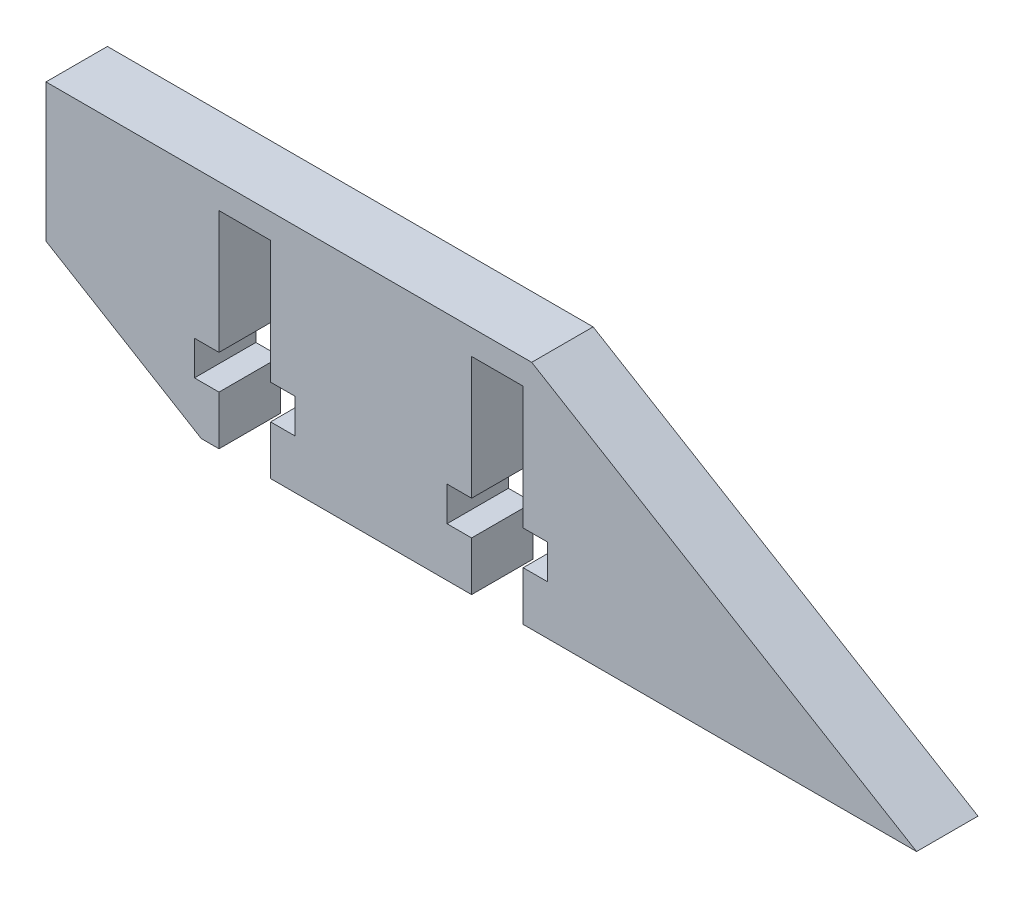
ISO-10303-21;
HEADER;
FILE_DESCRIPTION(('STEP AP214'),'2;1');
FILE_NAME('part.step','',(''),(''),'','','');
FILE_SCHEMA(('AUTOMOTIVE_DESIGN { 1 0 10303 214 1 1 1 1 }'));
ENDSEC;
DATA;
#1=APPLICATION_CONTEXT('core data for automotive mechanical design processes');
#2=APPLICATION_PROTOCOL_DEFINITION('international standard','automotive_design',2000,#1);
#3=PRODUCT_CONTEXT('',#1,'mechanical');
#4=PRODUCT('Part','Part','',(#3));
#5=PRODUCT_RELATED_PRODUCT_CATEGORY('part','',(#4));
#6=PRODUCT_DEFINITION_FORMATION('','',#4);
#7=PRODUCT_DEFINITION_CONTEXT('part definition',#1,'design');
#8=PRODUCT_DEFINITION('design','',#6,#7);
#9=PRODUCT_DEFINITION_SHAPE('','',#8);
#10=(LENGTH_UNIT() NAMED_UNIT(*) SI_UNIT(.MILLI.,.METRE.));
#11=(NAMED_UNIT(*) PLANE_ANGLE_UNIT() SI_UNIT($,.RADIAN.));
#12=(NAMED_UNIT(*) SI_UNIT($,.STERADIAN.) SOLID_ANGLE_UNIT());
#13=UNCERTAINTY_MEASURE_WITH_UNIT(LENGTH_MEASURE(1.E-05),#10,'distance_accuracy_value','');
#14=(GEOMETRIC_REPRESENTATION_CONTEXT(3) GLOBAL_UNCERTAINTY_ASSIGNED_CONTEXT((#13)) GLOBAL_UNIT_ASSIGNED_CONTEXT((#10,
#11,#12)) REPRESENTATION_CONTEXT('',''));
#15=CARTESIAN_POINT('',(0.,0.,0.));
#16=DIRECTION('',(0.,0.,1.));
#17=DIRECTION('',(1.,0.,0.));
#18=AXIS2_PLACEMENT_3D('',#15,#16,#17);
#19=CARTESIAN_POINT('',(-282.039404117024,408.696835159229,-223.000000000622));
#20=DIRECTION('',(0.,-1.,0.));
#21=DIRECTION('',(1.,0.,0.));
#22=AXIS2_PLACEMENT_3D('',#19,#20,#21);
#23=PLANE('',#22);
#24=DIRECTION('',(0.,0.,-1.));
#25=VECTOR('',#24,1.);
#26=CARTESIAN_POINT('',(-318.275750373979,408.696835159229,-218.000000000622));
#27=LINE('',#26,#25);
#28=CARTESIAN_POINT('',(-318.275750373979,408.696835159229,-218.000000000622));
#29=VERTEX_POINT('',#28);
#30=CARTESIAN_POINT('',(-318.275750373979,408.696835159229,-223.000000000622));
#31=VERTEX_POINT('',#30);
#32=EDGE_CURVE('E279',#29,#31,#27,.T.);
#33=ORIENTED_EDGE('',*,*,#32,.F.);
#34=DIRECTION('',(1.,0.,0.));
#35=VECTOR('',#34,1.);
#36=CARTESIAN_POINT('',(-282.039404117024,408.696835159229,-218.000000000622));
#37=LINE('',#36,#35);
#38=CARTESIAN_POINT('',(-334.643972624095,408.696835159229,-218.000000000622));
#39=VERTEX_POINT('',#38);
#40=EDGE_CURVE('E249',#39,#29,#37,.T.);
#41=ORIENTED_EDGE('',*,*,#40,.F.);
#42=DIRECTION('',(0.,0.,-1.));
#43=VECTOR('',#42,1.);
#44=CARTESIAN_POINT('',(-334.643972624095,408.696835159229,-218.000000000622));
#45=LINE('',#44,#43);
#46=CARTESIAN_POINT('',(-334.643972624095,408.696835159229,-223.000000000622));
#47=VERTEX_POINT('',#46);
#48=EDGE_CURVE('E252',#39,#47,#45,.T.);
#49=ORIENTED_EDGE('',*,*,#48,.T.);
#50=DIRECTION('',(1.,0.,0.));
#51=VECTOR('',#50,1.);
#52=CARTESIAN_POINT('',(-282.039404117024,408.696835159229,-223.000000000622));
#53=LINE('',#52,#51);
#54=EDGE_CURVE('E451',#47,#31,#53,.T.);
#55=ORIENTED_EDGE('',*,*,#54,.T.);
#56=EDGE_LOOP('',(#33,#41,#49,#55));
#57=FACE_BOUND('',#56,.T.);
#58=ADVANCED_FACE('F33',(#57),#23,.T.);
#59=DIRECTION('',(0.,0.,-1.));
#60=VECTOR('',#59,1.);
#61=CARTESIAN_POINT('',(-338.843972624095,408.696835159229,-218.000000000622));
#62=LINE('',#61,#60);
#63=CARTESIAN_POINT('',(-338.843972624095,408.696835159229,-218.000000000622));
#64=VERTEX_POINT('',#63);
#65=CARTESIAN_POINT('',(-338.843972624095,408.696835159229,-223.000000000622));
#66=VERTEX_POINT('',#65);
#67=EDGE_CURVE('E250',#64,#66,#62,.T.);
#68=ORIENTED_EDGE('',*,*,#67,.F.);
#69=CARTESIAN_POINT('',(-340.287524909335,408.696835159229,-218.000000000622));
#70=VERTEX_POINT('',#69);
#71=EDGE_CURVE('E438',#70,#64,#37,.T.);
#72=ORIENTED_EDGE('',*,*,#71,.F.);
#73=DIRECTION('',(0.,0.,1.));
#74=VECTOR('',#73,1.);
#75=CARTESIAN_POINT('',(-340.287524909335,408.696835159229,-223.000000000622));
#76=LINE('',#75,#74);
#77=CARTESIAN_POINT('',(-340.287524909335,408.696835159229,-223.000000000622));
#78=VERTEX_POINT('',#77);
#79=EDGE_CURVE('E42',#78,#70,#76,.T.);
#80=ORIENTED_EDGE('',*,*,#79,.F.);
#81=EDGE_CURVE('E448',#78,#66,#53,.T.);
#82=ORIENTED_EDGE('',*,*,#81,.T.);
#83=EDGE_LOOP('',(#68,#72,#80,#82));
#84=FACE_BOUND('',#83,.T.);
#85=ADVANCED_FACE('F495',(#84),#23,.T.);
#86=CARTESIAN_POINT('',(-313.380404336935,427.528407952308,-223.000000000622));
#87=DIRECTION('',(0.515038074910056,0.857167300702111,0.));
#88=DIRECTION('',(-0.857167300702111,0.515038074910056,0.));
#89=AXIS2_PLACEMENT_3D('',#86,#87,#88);
#90=PLANE('',#89);
#91=DIRECTION('',(-0.857167300702111,0.515038074910056,0.));
#92=VECTOR('',#91,1.);
#93=CARTESIAN_POINT('',(-313.380404336935,427.528407952308,-218.000000000622));
#94=LINE('',#93,#92);
#95=CARTESIAN_POINT('',(-282.039404117024,408.696835159229,-218.000000000622));
#96=VERTEX_POINT('',#95);
#97=CARTESIAN_POINT('',(-313.380404336935,427.528407952308,-218.000000000622));
#98=VERTEX_POINT('',#97);
#99=EDGE_CURVE('E433',#96,#98,#94,.T.);
#100=ORIENTED_EDGE('',*,*,#99,.F.);
#101=DIRECTION('',(0.,0.,1.));
#102=VECTOR('',#101,1.);
#103=CARTESIAN_POINT('',(-282.039404117024,408.696835159229,-223.000000000622));
#104=LINE('',#103,#102);
#105=CARTESIAN_POINT('',(-282.039404117024,408.696835159229,-223.000000000622));
#106=VERTEX_POINT('',#105);
#107=EDGE_CURVE('E11',#106,#96,#104,.T.);
#108=ORIENTED_EDGE('',*,*,#107,.F.);
#109=DIRECTION('',(-0.857167300702111,0.515038074910056,0.));
#110=VECTOR('',#109,1.);
#111=CARTESIAN_POINT('',(-313.380404336935,427.528407952308,-223.000000000622));
#112=LINE('',#111,#110);
#113=CARTESIAN_POINT('',(-313.380404336935,427.528407952308,-223.000000000622));
#114=VERTEX_POINT('',#113);
#115=EDGE_CURVE('E434',#106,#114,#112,.T.);
#116=ORIENTED_EDGE('',*,*,#115,.T.);
#117=DIRECTION('',(0.,0.,1.));
#118=VECTOR('',#117,1.);
#119=CARTESIAN_POINT('',(-313.380404336935,427.528407952308,-223.000000000622));
#120=LINE('',#119,#118);
#121=EDGE_CURVE('E37',#114,#98,#120,.T.);
#122=ORIENTED_EDGE('',*,*,#121,.T.);
#123=EDGE_LOOP('',(#100,#108,#116,#122));
#124=FACE_BOUND('',#123,.T.);
#125=ADVANCED_FACE('F35',(#124),#90,.T.);
#126=DIRECTION('',(0.,0.,-1.));
#127=VECTOR('',#126,1.);
#128=CARTESIAN_POINT('',(-314.075750373979,408.696835159229,-218.000000000622));
#129=LINE('',#128,#127);
#130=CARTESIAN_POINT('',(-314.075750373979,408.696835159229,-218.000000000622));
#131=VERTEX_POINT('',#130);
#132=CARTESIAN_POINT('',(-314.075750373979,408.696835159229,-223.000000000622));
#133=VERTEX_POINT('',#132);
#134=EDGE_CURVE('E282',#131,#133,#129,.T.);
#135=ORIENTED_EDGE('',*,*,#134,.T.);
#136=EDGE_CURVE('E447',#133,#106,#53,.T.);
#137=ORIENTED_EDGE('',*,*,#136,.T.);
#138=ORIENTED_EDGE('',*,*,#107,.T.);
#139=EDGE_CURVE('E463',#131,#96,#37,.T.);
#140=ORIENTED_EDGE('',*,*,#139,.F.);
#141=EDGE_LOOP('',(#135,#137,#138,#140));
#142=FACE_BOUND('',#141,.T.);
#143=ADVANCED_FACE('F481',(#142),#23,.T.);
#144=CARTESIAN_POINT('',(-340.287524909335,408.696835159229,-223.000000000622));
#145=DIRECTION('',(-0.515038074910054,-0.857167300702113,0.));
#146=DIRECTION('',(0.857167300702113,-0.515038074910054,0.));
#147=AXIS2_PLACEMENT_3D('',#144,#145,#146);
#148=PLANE('',#147);
#149=DIRECTION('',(0.857167300702113,-0.515038074910054,0.));
#150=VECTOR('',#149,1.);
#151=CARTESIAN_POINT('',(-340.287524909335,408.696835159229,-218.000000000622));
#152=LINE('',#151,#150);
#153=CARTESIAN_POINT('',(-352.932442284075,416.294668040568,-218.000000000622));
#154=VERTEX_POINT('',#153);
#155=EDGE_CURVE('E460',#154,#70,#152,.T.);
#156=ORIENTED_EDGE('',*,*,#155,.F.);
#157=DIRECTION('',(0.,0.,1.));
#158=VECTOR('',#157,1.);
#159=CARTESIAN_POINT('',(-352.932442284075,416.294668040568,-223.000000000622));
#160=LINE('',#159,#158);
#161=CARTESIAN_POINT('',(-352.932442284075,416.294668040568,-223.000000000622));
#162=VERTEX_POINT('',#161);
#163=EDGE_CURVE('E467',#162,#154,#160,.T.);
#164=ORIENTED_EDGE('',*,*,#163,.F.);
#165=DIRECTION('',(0.857167300702113,-0.515038074910054,0.));
#166=VECTOR('',#165,1.);
#167=CARTESIAN_POINT('',(-340.287524909335,408.696835159229,-223.000000000622));
#168=LINE('',#167,#166);
#169=EDGE_CURVE('E444',#162,#78,#168,.T.);
#170=ORIENTED_EDGE('',*,*,#169,.T.);
#171=ORIENTED_EDGE('',*,*,#79,.T.);
#172=EDGE_LOOP('',(#156,#164,#170,#171));
#173=FACE_BOUND('',#172,.T.);
#174=ADVANCED_FACE('F569',(#173),#148,.T.);
#175=CARTESIAN_POINT('',(-352.932442284075,416.294668040568,-223.000000000622));
#176=DIRECTION('',(-1.,0.,0.));
#177=DIRECTION('',(0.,0.,1.));
#178=AXIS2_PLACEMENT_3D('',#175,#176,#177);
#179=PLANE('',#178);
#180=DIRECTION('',(0.,-1.,0.));
#181=VECTOR('',#180,1.);
#182=CARTESIAN_POINT('',(-352.932442284075,416.294668040568,-218.000000000622));
#183=LINE('',#182,#181);
#184=CARTESIAN_POINT('',(-352.932442284075,427.528407952308,-218.000000000622));
#185=VERTEX_POINT('',#184);
#186=EDGE_CURVE('E457',#185,#154,#183,.T.);
#187=ORIENTED_EDGE('',*,*,#186,.F.);
#188=DIRECTION('',(0.,0.,1.));
#189=VECTOR('',#188,1.);
#190=CARTESIAN_POINT('',(-352.932442284075,427.528407952308,-223.000000000622));
#191=LINE('',#190,#189);
#192=CARTESIAN_POINT('',(-352.932442284075,427.528407952308,-223.000000000622));
#193=VERTEX_POINT('',#192);
#194=EDGE_CURVE('E468',#193,#185,#191,.T.);
#195=ORIENTED_EDGE('',*,*,#194,.F.);
#196=DIRECTION('',(0.,-1.,0.));
#197=VECTOR('',#196,1.);
#198=CARTESIAN_POINT('',(-352.932442284075,416.294668040568,-223.000000000622));
#199=LINE('',#198,#197);
#200=EDGE_CURVE('E441',#193,#162,#199,.T.);
#201=ORIENTED_EDGE('',*,*,#200,.T.);
#202=ORIENTED_EDGE('',*,*,#163,.T.);
#203=EDGE_LOOP('',(#187,#195,#201,#202));
#204=FACE_BOUND('',#203,.T.);
#205=ADVANCED_FACE('F489',(#204),#179,.T.);
#206=CARTESIAN_POINT('',(-352.932442284075,427.528407952308,-223.000000000622));
#207=DIRECTION('',(0.,1.,0.));
#208=DIRECTION('',(-1.,0.,0.));
#209=AXIS2_PLACEMENT_3D('',#206,#207,#208);
#210=PLANE('',#209);
#211=DIRECTION('',(-1.,0.,0.));
#212=VECTOR('',#211,1.);
#213=CARTESIAN_POINT('',(-352.932442284075,427.528407952308,-218.000000000622));
#214=LINE('',#213,#212);
#215=EDGE_CURVE('E454',#98,#185,#214,.T.);
#216=ORIENTED_EDGE('',*,*,#215,.F.);
#217=ORIENTED_EDGE('',*,*,#121,.F.);
#218=DIRECTION('',(-1.,0.,0.));
#219=VECTOR('',#218,1.);
#220=CARTESIAN_POINT('',(-352.932442284075,427.528407952308,-223.000000000622));
#221=LINE('',#220,#219);
#222=EDGE_CURVE('E437',#114,#193,#221,.T.);
#223=ORIENTED_EDGE('',*,*,#222,.T.);
#224=ORIENTED_EDGE('',*,*,#194,.T.);
#225=EDGE_LOOP('',(#216,#217,#223,#224));
#226=FACE_BOUND('',#225,.T.);
#227=ADVANCED_FACE('F477',(#226),#210,.T.);
#228=CARTESIAN_POINT('',(0.,0.,-223.000000000622));
#229=DIRECTION('',(0.,0.,1.));
#230=DIRECTION('',(1.,0.,0.));
#231=AXIS2_PLACEMENT_3D('',#228,#229,#230);
#232=PLANE('',#231);
#233=DIRECTION('',(1.,0.,0.));
#234=VECTOR('',#233,1.);
#235=CARTESIAN_POINT('',(0.,412.696835159229,-223.000000000622));
#236=LINE('',#235,#234);
#237=CARTESIAN_POINT('',(-320.275750373979,412.696835159229,-223.000000000622));
#238=VERTEX_POINT('',#237);
#239=CARTESIAN_POINT('',(-318.275750373979,412.696835159229,-223.000000000622));
#240=VERTEX_POINT('',#239);
#241=EDGE_CURVE('E403',#238,#240,#236,.T.);
#242=ORIENTED_EDGE('',*,*,#241,.T.);
#243=DIRECTION('',(0.,-1.,0.));
#244=VECTOR('',#243,1.);
#245=CARTESIAN_POINT('',(-318.275750373979,0.,-223.000000000622));
#246=LINE('',#245,#244);
#247=EDGE_CURVE('E234',#240,#31,#246,.T.);
#248=ORIENTED_EDGE('',*,*,#247,.T.);
#249=ORIENTED_EDGE('',*,*,#54,.F.);
#250=DIRECTION('',(0.,1.,0.));
#251=VECTOR('',#250,1.);
#252=CARTESIAN_POINT('',(-334.643972624095,0.,-223.000000000622));
#253=LINE('',#252,#251);
#254=CARTESIAN_POINT('',(-334.643972624095,412.696835159229,-223.000000000622));
#255=VERTEX_POINT('',#254);
#256=EDGE_CURVE('E397',#47,#255,#253,.T.);
#257=ORIENTED_EDGE('',*,*,#256,.T.);
#258=DIRECTION('',(1.,0.,0.));
#259=VECTOR('',#258,1.);
#260=CARTESIAN_POINT('',(0.,412.696835159229,-223.000000000622));
#261=LINE('',#260,#259);
#262=CARTESIAN_POINT('',(-332.643972624095,412.696835159229,-223.000000000622));
#263=VERTEX_POINT('',#262);
#264=EDGE_CURVE('E394',#255,#263,#261,.T.);
#265=ORIENTED_EDGE('',*,*,#264,.T.);
#266=DIRECTION('',(0.,1.,0.));
#267=VECTOR('',#266,1.);
#268=CARTESIAN_POINT('',(-332.643972624095,0.,-223.000000000622));
#269=LINE('',#268,#267);
#270=CARTESIAN_POINT('',(-332.643972624095,415.496835159229,-223.000000000622));
#271=VERTEX_POINT('',#270);
#272=EDGE_CURVE('E391',#263,#271,#269,.T.);
#273=ORIENTED_EDGE('',*,*,#272,.T.);
#274=DIRECTION('',(-1.,0.,0.));
#275=VECTOR('',#274,1.);
#276=CARTESIAN_POINT('',(0.,415.496835159229,-223.000000000622));
#277=LINE('',#276,#275);
#278=CARTESIAN_POINT('',(-334.643972624095,415.496835159229,-223.000000000622));
#279=VERTEX_POINT('',#278);
#280=EDGE_CURVE('E388',#271,#279,#277,.T.);
#281=ORIENTED_EDGE('',*,*,#280,.T.);
#282=DIRECTION('',(0.,1.,0.));
#283=VECTOR('',#282,1.);
#284=CARTESIAN_POINT('',(-334.643972624097,1.85764721729652E-12,-223.000000000622));
#285=LINE('',#284,#283);
#286=CARTESIAN_POINT('',(-334.643972624095,425.496835159229,-223.000000000622));
#287=VERTEX_POINT('',#286);
#288=EDGE_CURVE('E385',#279,#287,#285,.T.);
#289=ORIENTED_EDGE('',*,*,#288,.T.);
#290=DIRECTION('',(-1.,0.,0.));
#291=VECTOR('',#290,1.);
#292=CARTESIAN_POINT('',(0.,425.496835159229,-223.000000000622));
#293=LINE('',#292,#291);
#294=CARTESIAN_POINT('',(-338.843972624095,425.496835159229,-223.000000000622));
#295=VERTEX_POINT('',#294);
#296=EDGE_CURVE('E382',#287,#295,#293,.T.);
#297=ORIENTED_EDGE('',*,*,#296,.T.);
#298=DIRECTION('',(0.,-1.,0.));
#299=VECTOR('',#298,1.);
#300=CARTESIAN_POINT('',(-338.843972624097,1.88096190081364E-12,-223.000000000622));
#301=LINE('',#300,#299);
#302=CARTESIAN_POINT('',(-338.843972624095,415.496835159229,-223.000000000622));
#303=VERTEX_POINT('',#302);
#304=EDGE_CURVE('E379',#295,#303,#301,.T.);
#305=ORIENTED_EDGE('',*,*,#304,.T.);
#306=DIRECTION('',(-1.,0.,0.));
#307=VECTOR('',#306,1.);
#308=CARTESIAN_POINT('',(0.,415.496835159229,-223.000000000622));
#309=LINE('',#308,#307);
#310=CARTESIAN_POINT('',(-340.843972624095,415.496835159229,-223.000000000622));
#311=VERTEX_POINT('',#310);
#312=EDGE_CURVE('E376',#303,#311,#309,.T.);
#313=ORIENTED_EDGE('',*,*,#312,.T.);
#314=DIRECTION('',(0.,-1.,0.));
#315=VECTOR('',#314,1.);
#316=CARTESIAN_POINT('',(-340.843972624095,0.,-223.000000000622));
#317=LINE('',#316,#315);
#318=CARTESIAN_POINT('',(-340.843972624095,412.696835159229,-223.000000000622));
#319=VERTEX_POINT('',#318);
#320=EDGE_CURVE('E373',#311,#319,#317,.T.);
#321=ORIENTED_EDGE('',*,*,#320,.T.);
#322=DIRECTION('',(1.,0.,0.));
#323=VECTOR('',#322,1.);
#324=CARTESIAN_POINT('',(0.,412.696835159229,-223.000000000622));
#325=LINE('',#324,#323);
#326=CARTESIAN_POINT('',(-338.843972624095,412.696835159229,-223.000000000622));
#327=VERTEX_POINT('',#326);
#328=EDGE_CURVE('E281',#319,#327,#325,.T.);
#329=ORIENTED_EDGE('',*,*,#328,.T.);
#330=DIRECTION('',(0.,-1.,0.));
#331=VECTOR('',#330,1.);
#332=CARTESIAN_POINT('',(-338.843972624095,0.,-223.000000000622));
#333=LINE('',#332,#331);
#334=EDGE_CURVE('E400',#327,#66,#333,.T.);
#335=ORIENTED_EDGE('',*,*,#334,.T.);
#336=ORIENTED_EDGE('',*,*,#81,.F.);
#337=ORIENTED_EDGE('',*,*,#169,.F.);
#338=ORIENTED_EDGE('',*,*,#200,.F.);
#339=ORIENTED_EDGE('',*,*,#222,.F.);
#340=ORIENTED_EDGE('',*,*,#115,.F.);
#341=ORIENTED_EDGE('',*,*,#136,.F.);
#342=DIRECTION('',(0.,1.,0.));
#343=VECTOR('',#342,1.);
#344=CARTESIAN_POINT('',(-314.075750373979,0.,-223.000000000622));
#345=LINE('',#344,#343);
#346=CARTESIAN_POINT('',(-314.075750373979,412.696835159229,-223.000000000622));
#347=VERTEX_POINT('',#346);
#348=EDGE_CURVE('E429',#133,#347,#345,.T.);
#349=ORIENTED_EDGE('',*,*,#348,.T.);
#350=DIRECTION('',(1.,0.,0.));
#351=VECTOR('',#350,1.);
#352=CARTESIAN_POINT('',(0.,412.696835159229,-223.000000000622));
#353=LINE('',#352,#351);
#354=CARTESIAN_POINT('',(-312.075750373979,412.696835159229,-223.000000000622));
#355=VERTEX_POINT('',#354);
#356=EDGE_CURVE('E426',#347,#355,#353,.T.);
#357=ORIENTED_EDGE('',*,*,#356,.T.);
#358=DIRECTION('',(0.,1.,0.));
#359=VECTOR('',#358,1.);
#360=CARTESIAN_POINT('',(-312.075750373979,0.,-223.000000000622));
#361=LINE('',#360,#359);
#362=CARTESIAN_POINT('',(-312.075750373979,415.496835159229,-223.000000000622));
#363=VERTEX_POINT('',#362);
#364=EDGE_CURVE('E423',#355,#363,#361,.T.);
#365=ORIENTED_EDGE('',*,*,#364,.T.);
#366=DIRECTION('',(-1.,0.,0.));
#367=VECTOR('',#366,1.);
#368=CARTESIAN_POINT('',(0.,415.496835159229,-223.000000000622));
#369=LINE('',#368,#367);
#370=CARTESIAN_POINT('',(-314.075750373979,415.496835159229,-223.000000000622));
#371=VERTEX_POINT('',#370);
#372=EDGE_CURVE('E420',#363,#371,#369,.T.);
#373=ORIENTED_EDGE('',*,*,#372,.T.);
#374=DIRECTION('',(0.,1.,0.));
#375=VECTOR('',#374,1.);
#376=CARTESIAN_POINT('',(-314.075750373979,0.,-223.000000000622));
#377=LINE('',#376,#375);
#378=CARTESIAN_POINT('',(-314.075750373979,425.496835159229,-223.000000000622));
#379=VERTEX_POINT('',#378);
#380=EDGE_CURVE('E417',#371,#379,#377,.T.);
#381=ORIENTED_EDGE('',*,*,#380,.T.);
#382=DIRECTION('',(-1.,0.,0.));
#383=VECTOR('',#382,1.);
#384=CARTESIAN_POINT('',(0.,425.496835159229,-223.000000000622));
#385=LINE('',#384,#383);
#386=CARTESIAN_POINT('',(-318.275750373979,425.496835159229,-223.000000000622));
#387=VERTEX_POINT('',#386);
#388=EDGE_CURVE('E414',#379,#387,#385,.T.);
#389=ORIENTED_EDGE('',*,*,#388,.T.);
#390=DIRECTION('',(0.,-1.,0.));
#391=VECTOR('',#390,1.);
#392=CARTESIAN_POINT('',(-318.275750373979,0.,-223.000000000622));
#393=LINE('',#392,#391);
#394=CARTESIAN_POINT('',(-318.275750373979,415.496835159229,-223.000000000622));
#395=VERTEX_POINT('',#394);
#396=EDGE_CURVE('E411',#387,#395,#393,.T.);
#397=ORIENTED_EDGE('',*,*,#396,.T.);
#398=DIRECTION('',(-1.,0.,0.));
#399=VECTOR('',#398,1.);
#400=CARTESIAN_POINT('',(0.,415.496835159229,-223.000000000622));
#401=LINE('',#400,#399);
#402=CARTESIAN_POINT('',(-320.275750373979,415.496835159229,-223.000000000622));
#403=VERTEX_POINT('',#402);
#404=EDGE_CURVE('E408',#395,#403,#401,.T.);
#405=ORIENTED_EDGE('',*,*,#404,.T.);
#406=DIRECTION('',(0.,-1.,0.));
#407=VECTOR('',#406,1.);
#408=CARTESIAN_POINT('',(-320.275750373979,0.,-223.000000000622));
#409=LINE('',#408,#407);
#410=EDGE_CURVE('E405',#403,#238,#409,.T.);
#411=ORIENTED_EDGE('',*,*,#410,.T.);
#412=EDGE_LOOP('',(#242,#248,#249,#257,#265,#273,#281,#289,#297,#305,#313,#321,#329,#335,#336,
#337,#338,#339,#340,#341,#349,#357,#365,#373,#381,#389,#397,#405,#411));
#413=FACE_BOUND('',#412,.T.);
#414=ADVANCED_FACE('F484',(#413),#232,.F.);
#415=CARTESIAN_POINT('',(0.,0.,-218.000000000622));
#416=DIRECTION('',(0.,0.,1.));
#417=DIRECTION('',(1.,0.,0.));
#418=AXIS2_PLACEMENT_3D('',#415,#416,#417);
#419=PLANE('',#418);
#420=DIRECTION('',(0.,1.,0.));
#421=VECTOR('',#420,1.);
#422=CARTESIAN_POINT('',(-318.275750373979,408.696835159229,-218.000000000622));
#423=LINE('',#422,#421);
#424=CARTESIAN_POINT('',(-318.275750373979,412.696835159229,-218.000000000622));
#425=VERTEX_POINT('',#424);
#426=EDGE_CURVE('E231',#29,#425,#423,.T.);
#427=ORIENTED_EDGE('',*,*,#426,.T.);
#428=DIRECTION('',(-1.,0.,0.));
#429=VECTOR('',#428,1.);
#430=CARTESIAN_POINT('',(-320.275750373979,412.696835159229,-218.000000000622));
#431=LINE('',#430,#429);
#432=CARTESIAN_POINT('',(-320.275750373979,412.696835159229,-218.000000000622));
#433=VERTEX_POINT('',#432);
#434=EDGE_CURVE('E241',#425,#433,#431,.T.);
#435=ORIENTED_EDGE('',*,*,#434,.T.);
#436=DIRECTION('',(0.,1.,0.));
#437=VECTOR('',#436,1.);
#438=CARTESIAN_POINT('',(-320.275750373979,412.696835159229,-218.000000000622));
#439=LINE('',#438,#437);
#440=CARTESIAN_POINT('',(-320.275750373979,415.496835159229,-218.000000000622));
#441=VERTEX_POINT('',#440);
#442=EDGE_CURVE('E50',#433,#441,#439,.T.);
#443=ORIENTED_EDGE('',*,*,#442,.T.);
#444=DIRECTION('',(1.,0.,0.));
#445=VECTOR('',#444,1.);
#446=CARTESIAN_POINT('',(-320.275750373979,415.496835159229,-218.000000000622));
#447=LINE('',#446,#445);
#448=CARTESIAN_POINT('',(-318.275750373979,415.496835159229,-218.000000000622));
#449=VERTEX_POINT('',#448);
#450=EDGE_CURVE('E256',#441,#449,#447,.T.);
#451=ORIENTED_EDGE('',*,*,#450,.T.);
#452=DIRECTION('',(0.,1.,0.));
#453=VECTOR('',#452,1.);
#454=CARTESIAN_POINT('',(-318.275750373979,415.496835159229,-218.000000000622));
#455=LINE('',#454,#453);
#456=CARTESIAN_POINT('',(-318.275750373979,425.496835159229,-218.000000000622));
#457=VERTEX_POINT('',#456);
#458=EDGE_CURVE('E259',#449,#457,#455,.T.);
#459=ORIENTED_EDGE('',*,*,#458,.T.);
#460=DIRECTION('',(1.,0.,0.));
#461=VECTOR('',#460,1.);
#462=CARTESIAN_POINT('',(-318.275750373979,425.496835159229,-218.000000000622));
#463=LINE('',#462,#461);
#464=CARTESIAN_POINT('',(-314.075750373979,425.496835159229,-218.000000000622));
#465=VERTEX_POINT('',#464);
#466=EDGE_CURVE('E262',#457,#465,#463,.T.);
#467=ORIENTED_EDGE('',*,*,#466,.T.);
#468=DIRECTION('',(0.,-1.,0.));
#469=VECTOR('',#468,1.);
#470=CARTESIAN_POINT('',(-314.075750373979,415.496835159229,-218.000000000622));
#471=LINE('',#470,#469);
#472=CARTESIAN_POINT('',(-314.075750373979,415.496835159229,-218.000000000622));
#473=VERTEX_POINT('',#472);
#474=EDGE_CURVE('E265',#465,#473,#471,.T.);
#475=ORIENTED_EDGE('',*,*,#474,.T.);
#476=DIRECTION('',(1.,0.,0.));
#477=VECTOR('',#476,1.);
#478=CARTESIAN_POINT('',(-314.075750373979,415.496835159229,-218.000000000622));
#479=LINE('',#478,#477);
#480=CARTESIAN_POINT('',(-312.075750373979,415.496835159229,-218.000000000622));
#481=VERTEX_POINT('',#480);
#482=EDGE_CURVE('E268',#473,#481,#479,.T.);
#483=ORIENTED_EDGE('',*,*,#482,.T.);
#484=DIRECTION('',(0.,-1.,0.));
#485=VECTOR('',#484,1.);
#486=CARTESIAN_POINT('',(-312.075750373979,412.696835159229,-218.000000000622));
#487=LINE('',#486,#485);
#488=CARTESIAN_POINT('',(-312.075750373979,412.696835159229,-218.000000000622));
#489=VERTEX_POINT('',#488);
#490=EDGE_CURVE('E271',#481,#489,#487,.T.);
#491=ORIENTED_EDGE('',*,*,#490,.T.);
#492=DIRECTION('',(-1.,0.,0.));
#493=VECTOR('',#492,1.);
#494=CARTESIAN_POINT('',(-314.075750373979,412.696835159229,-218.000000000622));
#495=LINE('',#494,#493);
#496=CARTESIAN_POINT('',(-314.075750373979,412.696835159229,-218.000000000622));
#497=VERTEX_POINT('',#496);
#498=EDGE_CURVE('E274',#489,#497,#495,.T.);
#499=ORIENTED_EDGE('',*,*,#498,.T.);
#500=DIRECTION('',(0.,-1.,0.));
#501=VECTOR('',#500,1.);
#502=CARTESIAN_POINT('',(-314.075750373979,408.696835159229,-218.000000000622));
#503=LINE('',#502,#501);
#504=EDGE_CURVE('E238',#497,#131,#503,.T.);
#505=ORIENTED_EDGE('',*,*,#504,.T.);
#506=ORIENTED_EDGE('',*,*,#139,.T.);
#507=ORIENTED_EDGE('',*,*,#99,.T.);
#508=ORIENTED_EDGE('',*,*,#215,.T.);
#509=ORIENTED_EDGE('',*,*,#186,.T.);
#510=ORIENTED_EDGE('',*,*,#155,.T.);
#511=ORIENTED_EDGE('',*,*,#71,.T.);
#512=DIRECTION('',(0.,1.,0.));
#513=VECTOR('',#512,1.);
#514=CARTESIAN_POINT('',(-338.843972624095,408.696835159229,-218.000000000622));
#515=LINE('',#514,#513);
#516=CARTESIAN_POINT('',(-338.843972624095,412.696835159229,-218.000000000622));
#517=VERTEX_POINT('',#516);
#518=EDGE_CURVE('E310',#64,#517,#515,.T.);
#519=ORIENTED_EDGE('',*,*,#518,.T.);
#520=DIRECTION('',(-1.,0.,0.));
#521=VECTOR('',#520,1.);
#522=CARTESIAN_POINT('',(-338.843972624095,412.696835159229,-218.000000000622));
#523=LINE('',#522,#521);
#524=CARTESIAN_POINT('',(-340.843972624095,412.696835159229,-218.000000000622));
#525=VERTEX_POINT('',#524);
#526=EDGE_CURVE('E313',#517,#525,#523,.T.);
#527=ORIENTED_EDGE('',*,*,#526,.T.);
#528=DIRECTION('',(0.,1.,0.));
#529=VECTOR('',#528,1.);
#530=CARTESIAN_POINT('',(-340.843972624095,412.696835159229,-218.000000000622));
#531=LINE('',#530,#529);
#532=CARTESIAN_POINT('',(-340.843972624095,415.496835159229,-218.000000000622));
#533=VERTEX_POINT('',#532);
#534=EDGE_CURVE('E58',#525,#533,#531,.T.);
#535=ORIENTED_EDGE('',*,*,#534,.T.);
#536=DIRECTION('',(1.,0.,0.));
#537=VECTOR('',#536,1.);
#538=CARTESIAN_POINT('',(-338.843972624095,415.496835159229,-218.000000000622));
#539=LINE('',#538,#537);
#540=CARTESIAN_POINT('',(-338.843972624095,415.496835159229,-218.000000000622));
#541=VERTEX_POINT('',#540);
#542=EDGE_CURVE('E317',#533,#541,#539,.T.);
#543=ORIENTED_EDGE('',*,*,#542,.T.);
#544=DIRECTION('',(0.,1.,0.));
#545=VECTOR('',#544,1.);
#546=CARTESIAN_POINT('',(-338.843972624095,415.496835159229,-218.000000000622));
#547=LINE('',#546,#545);
#548=CARTESIAN_POINT('',(-338.843972624095,425.496835159229,-218.000000000622));
#549=VERTEX_POINT('',#548);
#550=EDGE_CURVE('E320',#541,#549,#547,.T.);
#551=ORIENTED_EDGE('',*,*,#550,.T.);
#552=DIRECTION('',(1.,0.,0.));
#553=VECTOR('',#552,1.);
#554=CARTESIAN_POINT('',(-334.643972624095,425.496835159229,-218.000000000622));
#555=LINE('',#554,#553);
#556=CARTESIAN_POINT('',(-334.643972624095,425.496835159229,-218.000000000622));
#557=VERTEX_POINT('',#556);
#558=EDGE_CURVE('E323',#549,#557,#555,.T.);
#559=ORIENTED_EDGE('',*,*,#558,.T.);
#560=DIRECTION('',(0.,-1.,0.));
#561=VECTOR('',#560,1.);
#562=CARTESIAN_POINT('',(-334.643972624095,415.496835159229,-218.000000000622));
#563=LINE('',#562,#561);
#564=CARTESIAN_POINT('',(-334.643972624095,415.496835159229,-218.000000000622));
#565=VERTEX_POINT('',#564);
#566=EDGE_CURVE('E326',#557,#565,#563,.T.);
#567=ORIENTED_EDGE('',*,*,#566,.T.);
#568=DIRECTION('',(1.,0.,0.));
#569=VECTOR('',#568,1.);
#570=CARTESIAN_POINT('',(-332.643972624095,415.496835159229,-218.000000000622));
#571=LINE('',#570,#569);
#572=CARTESIAN_POINT('',(-332.643972624095,415.496835159229,-218.000000000622));
#573=VERTEX_POINT('',#572);
#574=EDGE_CURVE('E329',#565,#573,#571,.T.);
#575=ORIENTED_EDGE('',*,*,#574,.T.);
#576=DIRECTION('',(0.,-1.,0.));
#577=VECTOR('',#576,1.);
#578=CARTESIAN_POINT('',(-332.643972624095,412.696835159229,-218.000000000622));
#579=LINE('',#578,#577);
#580=CARTESIAN_POINT('',(-332.643972624095,412.696835159229,-218.000000000622));
#581=VERTEX_POINT('',#580);
#582=EDGE_CURVE('E332',#573,#581,#579,.T.);
#583=ORIENTED_EDGE('',*,*,#582,.T.);
#584=DIRECTION('',(-1.,0.,0.));
#585=VECTOR('',#584,1.);
#586=CARTESIAN_POINT('',(-332.643972624095,412.696835159229,-218.000000000622));
#587=LINE('',#586,#585);
#588=CARTESIAN_POINT('',(-334.643972624095,412.696835159229,-218.000000000622));
#589=VERTEX_POINT('',#588);
#590=EDGE_CURVE('E335',#581,#589,#587,.T.);
#591=ORIENTED_EDGE('',*,*,#590,.T.);
#592=DIRECTION('',(0.,-1.,0.));
#593=VECTOR('',#592,1.);
#594=CARTESIAN_POINT('',(-334.643972624095,408.696835159229,-218.000000000622));
#595=LINE('',#594,#593);
#596=EDGE_CURVE('E338',#589,#39,#595,.T.);
#597=ORIENTED_EDGE('',*,*,#596,.T.);
#598=ORIENTED_EDGE('',*,*,#40,.T.);
#599=EDGE_LOOP('',(#427,#435,#443,#451,#459,#467,#475,#483,#491,#499,#505,#506,#507,#508,#509,
#510,#511,#519,#527,#535,#543,#551,#559,#567,#575,#583,#591,#597,#598));
#600=FACE_BOUND('',#599,.T.);
#601=ADVANCED_FACE('F246',(#600),#419,.T.);
#602=CARTESIAN_POINT('',(-338.843972624095,408.696835159229,-218.000000000622));
#603=DIRECTION('',(-1.,0.,0.));
#604=DIRECTION('',(0.,0.,1.));
#605=AXIS2_PLACEMENT_3D('',#602,#603,#604);
#606=PLANE('',#605);
#607=DIRECTION('',(0.,0.,-1.));
#608=VECTOR('',#607,1.);
#609=CARTESIAN_POINT('',(-338.843972624095,412.696835159229,-218.000000000622));
#610=LINE('',#609,#608);
#611=EDGE_CURVE('E339',#517,#327,#610,.T.);
#612=ORIENTED_EDGE('',*,*,#611,.F.);
#613=ORIENTED_EDGE('',*,*,#518,.F.);
#614=ORIENTED_EDGE('',*,*,#67,.T.);
#615=ORIENTED_EDGE('',*,*,#334,.F.);
#616=EDGE_LOOP('',(#612,#613,#614,#615));
#617=FACE_BOUND('',#616,.T.);
#618=ADVANCED_FACE('F497',(#617),#606,.F.);
#619=CARTESIAN_POINT('',(-334.643972624095,408.696835159229,-218.000000000622));
#620=DIRECTION('',(1.,0.,0.));
#621=DIRECTION('',(0.,0.,-1.));
#622=AXIS2_PLACEMENT_3D('',#619,#620,#621);
#623=PLANE('',#622);
#624=ORIENTED_EDGE('',*,*,#48,.F.);
#625=ORIENTED_EDGE('',*,*,#596,.F.);
#626=DIRECTION('',(0.,0.,-1.));
#627=VECTOR('',#626,1.);
#628=CARTESIAN_POINT('',(-334.643972624095,412.696835159229,-218.000000000622));
#629=LINE('',#628,#627);
#630=EDGE_CURVE('E343',#589,#255,#629,.T.);
#631=ORIENTED_EDGE('',*,*,#630,.T.);
#632=ORIENTED_EDGE('',*,*,#256,.F.);
#633=EDGE_LOOP('',(#624,#625,#631,#632));
#634=FACE_BOUND('',#633,.T.);
#635=ADVANCED_FACE('F525',(#634),#623,.F.);
#636=CARTESIAN_POINT('',(-332.643972624095,412.696835159229,-218.000000000622));
#637=DIRECTION('',(0.,-1.,0.));
#638=DIRECTION('',(0.,0.,-1.));
#639=AXIS2_PLACEMENT_3D('',#636,#637,#638);
#640=PLANE('',#639);
#641=ORIENTED_EDGE('',*,*,#630,.F.);
#642=ORIENTED_EDGE('',*,*,#590,.F.);
#643=DIRECTION('',(0.,0.,-1.));
#644=VECTOR('',#643,1.);
#645=CARTESIAN_POINT('',(-332.643972624095,412.696835159229,-218.000000000622));
#646=LINE('',#645,#644);
#647=EDGE_CURVE('E346',#581,#263,#646,.T.);
#648=ORIENTED_EDGE('',*,*,#647,.T.);
#649=ORIENTED_EDGE('',*,*,#264,.F.);
#650=EDGE_LOOP('',(#641,#642,#648,#649));
#651=FACE_BOUND('',#650,.T.);
#652=ADVANCED_FACE('F523',(#651),#640,.F.);
#653=CARTESIAN_POINT('',(-332.643972624095,412.696835159229,-218.000000000622));
#654=DIRECTION('',(1.,0.,0.));
#655=DIRECTION('',(0.,0.,-1.));
#656=AXIS2_PLACEMENT_3D('',#653,#654,#655);
#657=PLANE('',#656);
#658=ORIENTED_EDGE('',*,*,#647,.F.);
#659=ORIENTED_EDGE('',*,*,#582,.F.);
#660=DIRECTION('',(0.,0.,-1.));
#661=VECTOR('',#660,1.);
#662=CARTESIAN_POINT('',(-332.643972624095,415.496835159229,-218.000000000622));
#663=LINE('',#662,#661);
#664=EDGE_CURVE('E349',#573,#271,#663,.T.);
#665=ORIENTED_EDGE('',*,*,#664,.T.);
#666=ORIENTED_EDGE('',*,*,#272,.F.);
#667=EDGE_LOOP('',(#658,#659,#665,#666));
#668=FACE_BOUND('',#667,.T.);
#669=ADVANCED_FACE('F519',(#668),#657,.F.);
#670=CARTESIAN_POINT('',(-332.643972624095,415.496835159229,-218.000000000622));
#671=DIRECTION('',(0.,1.,0.));
#672=DIRECTION('',(0.,0.,1.));
#673=AXIS2_PLACEMENT_3D('',#670,#671,#672);
#674=PLANE('',#673);
#675=ORIENTED_EDGE('',*,*,#664,.F.);
#676=ORIENTED_EDGE('',*,*,#574,.F.);
#677=DIRECTION('',(0.,0.,-1.));
#678=VECTOR('',#677,1.);
#679=CARTESIAN_POINT('',(-334.643972624095,415.496835159229,-218.000000000622));
#680=LINE('',#679,#678);
#681=EDGE_CURVE('E352',#565,#279,#680,.T.);
#682=ORIENTED_EDGE('',*,*,#681,.T.);
#683=ORIENTED_EDGE('',*,*,#280,.F.);
#684=EDGE_LOOP('',(#675,#676,#682,#683));
#685=FACE_BOUND('',#684,.T.);
#686=ADVANCED_FACE('F516',(#685),#674,.F.);
#687=CARTESIAN_POINT('',(-334.643972624095,415.496835159229,-218.000000000622));
#688=DIRECTION('',(1.,0.,0.));
#689=DIRECTION('',(0.,1.,0.));
#690=AXIS2_PLACEMENT_3D('',#687,#688,#689);
#691=PLANE('',#690);
#692=ORIENTED_EDGE('',*,*,#681,.F.);
#693=ORIENTED_EDGE('',*,*,#566,.F.);
#694=DIRECTION('',(0.,0.,-1.));
#695=VECTOR('',#694,1.);
#696=CARTESIAN_POINT('',(-334.643972624095,425.496835159229,-218.000000000622));
#697=LINE('',#696,#695);
#698=EDGE_CURVE('E355',#557,#287,#697,.T.);
#699=ORIENTED_EDGE('',*,*,#698,.T.);
#700=ORIENTED_EDGE('',*,*,#288,.F.);
#701=EDGE_LOOP('',(#692,#693,#699,#700));
#702=FACE_BOUND('',#701,.T.);
#703=ADVANCED_FACE('F514',(#702),#691,.F.);
#704=CARTESIAN_POINT('',(-334.643972624095,425.496835159229,-218.000000000622));
#705=DIRECTION('',(0.,1.,0.));
#706=DIRECTION('',(0.,0.,1.));
#707=AXIS2_PLACEMENT_3D('',#704,#705,#706);
#708=PLANE('',#707);
#709=ORIENTED_EDGE('',*,*,#698,.F.);
#710=ORIENTED_EDGE('',*,*,#558,.F.);
#711=DIRECTION('',(0.,0.,-1.));
#712=VECTOR('',#711,1.);
#713=CARTESIAN_POINT('',(-338.843972624095,425.496835159229,-218.000000000622));
#714=LINE('',#713,#712);
#715=EDGE_CURVE('E358',#549,#295,#714,.T.);
#716=ORIENTED_EDGE('',*,*,#715,.T.);
#717=ORIENTED_EDGE('',*,*,#296,.F.);
#718=EDGE_LOOP('',(#709,#710,#716,#717));
#719=FACE_BOUND('',#718,.T.);
#720=ADVANCED_FACE('F510',(#719),#708,.F.);
#721=CARTESIAN_POINT('',(-338.843972624095,415.496835159229,-218.000000000622));
#722=DIRECTION('',(-1.,0.,0.));
#723=DIRECTION('',(0.,-1.,0.));
#724=AXIS2_PLACEMENT_3D('',#721,#722,#723);
#725=PLANE('',#724);
#726=ORIENTED_EDGE('',*,*,#715,.F.);
#727=ORIENTED_EDGE('',*,*,#550,.F.);
#728=DIRECTION('',(0.,0.,-1.));
#729=VECTOR('',#728,1.);
#730=CARTESIAN_POINT('',(-338.843972624095,415.496835159229,-218.000000000622));
#731=LINE('',#730,#729);
#732=EDGE_CURVE('E361',#541,#303,#731,.T.);
#733=ORIENTED_EDGE('',*,*,#732,.T.);
#734=ORIENTED_EDGE('',*,*,#304,.F.);
#735=EDGE_LOOP('',(#726,#727,#733,#734));
#736=FACE_BOUND('',#735,.T.);
#737=ADVANCED_FACE('F506',(#736),#725,.F.);
#738=CARTESIAN_POINT('',(-338.843972624095,415.496835159229,-218.000000000622));
#739=DIRECTION('',(0.,1.,0.));
#740=DIRECTION('',(0.,0.,1.));
#741=AXIS2_PLACEMENT_3D('',#738,#739,#740);
#742=PLANE('',#741);
#743=ORIENTED_EDGE('',*,*,#732,.F.);
#744=ORIENTED_EDGE('',*,*,#542,.F.);
#745=DIRECTION('',(0.,0.,-1.));
#746=VECTOR('',#745,1.);
#747=CARTESIAN_POINT('',(-340.843972624095,415.496835159229,-218.000000000622));
#748=LINE('',#747,#746);
#749=EDGE_CURVE('E364',#533,#311,#748,.T.);
#750=ORIENTED_EDGE('',*,*,#749,.T.);
#751=ORIENTED_EDGE('',*,*,#312,.F.);
#752=EDGE_LOOP('',(#743,#744,#750,#751));
#753=FACE_BOUND('',#752,.T.);
#754=ADVANCED_FACE('F504',(#753),#742,.F.);
#755=CARTESIAN_POINT('',(-340.843972624095,412.696835159229,-218.000000000622));
#756=DIRECTION('',(-1.,0.,0.));
#757=DIRECTION('',(0.,0.,1.));
#758=AXIS2_PLACEMENT_3D('',#755,#756,#757);
#759=PLANE('',#758);
#760=ORIENTED_EDGE('',*,*,#749,.F.);
#761=ORIENTED_EDGE('',*,*,#534,.F.);
#762=DIRECTION('',(0.,0.,-1.));
#763=VECTOR('',#762,1.);
#764=CARTESIAN_POINT('',(-340.843972624095,412.696835159229,-218.000000000622));
#765=LINE('',#764,#763);
#766=EDGE_CURVE('E367',#525,#319,#765,.T.);
#767=ORIENTED_EDGE('',*,*,#766,.T.);
#768=ORIENTED_EDGE('',*,*,#320,.F.);
#769=EDGE_LOOP('',(#760,#761,#767,#768));
#770=FACE_BOUND('',#769,.T.);
#771=ADVANCED_FACE('F501',(#770),#759,.F.);
#772=CARTESIAN_POINT('',(-338.843972624095,412.696835159229,-218.000000000622));
#773=DIRECTION('',(0.,-1.,0.));
#774=DIRECTION('',(0.,0.,-1.));
#775=AXIS2_PLACEMENT_3D('',#772,#773,#774);
#776=PLANE('',#775);
#777=ORIENTED_EDGE('',*,*,#766,.F.);
#778=ORIENTED_EDGE('',*,*,#526,.F.);
#779=ORIENTED_EDGE('',*,*,#611,.T.);
#780=ORIENTED_EDGE('',*,*,#328,.F.);
#781=EDGE_LOOP('',(#777,#778,#779,#780));
#782=FACE_BOUND('',#781,.T.);
#783=ADVANCED_FACE('F499',(#782),#776,.F.);
#784=CARTESIAN_POINT('',(-318.275750373979,408.696835159229,-218.000000000622));
#785=DIRECTION('',(-1.,0.,0.));
#786=DIRECTION('',(0.,0.,1.));
#787=AXIS2_PLACEMENT_3D('',#784,#785,#786);
#788=PLANE('',#787);
#789=DIRECTION('',(0.,0.,-1.));
#790=VECTOR('',#789,1.);
#791=CARTESIAN_POINT('',(-318.275750373979,412.696835159229,-218.000000000622));
#792=LINE('',#791,#790);
#793=EDGE_CURVE('E227',#425,#240,#792,.T.);
#794=ORIENTED_EDGE('',*,*,#793,.F.);
#795=ORIENTED_EDGE('',*,*,#426,.F.);
#796=ORIENTED_EDGE('',*,*,#32,.T.);
#797=ORIENTED_EDGE('',*,*,#247,.F.);
#798=EDGE_LOOP('',(#794,#795,#796,#797));
#799=FACE_BOUND('',#798,.T.);
#800=ADVANCED_FACE('F229',(#799),#788,.F.);
#801=CARTESIAN_POINT('',(-314.075750373979,408.696835159229,-218.000000000622));
#802=DIRECTION('',(1.,0.,0.));
#803=DIRECTION('',(0.,0.,-1.));
#804=AXIS2_PLACEMENT_3D('',#801,#802,#803);
#805=PLANE('',#804);
#806=ORIENTED_EDGE('',*,*,#134,.F.);
#807=ORIENTED_EDGE('',*,*,#504,.F.);
#808=DIRECTION('',(0.,0.,-1.));
#809=VECTOR('',#808,1.);
#810=CARTESIAN_POINT('',(-314.075750373979,412.696835159229,-218.000000000622));
#811=LINE('',#810,#809);
#812=EDGE_CURVE('E285',#497,#347,#811,.T.);
#813=ORIENTED_EDGE('',*,*,#812,.T.);
#814=ORIENTED_EDGE('',*,*,#348,.F.);
#815=EDGE_LOOP('',(#806,#807,#813,#814));
#816=FACE_BOUND('',#815,.T.);
#817=ADVANCED_FACE('F552',(#816),#805,.F.);
#818=CARTESIAN_POINT('',(-314.075750373979,412.696835159229,-218.000000000622));
#819=DIRECTION('',(0.,-1.,0.));
#820=DIRECTION('',(0.,0.,-1.));
#821=AXIS2_PLACEMENT_3D('',#818,#819,#820);
#822=PLANE('',#821);
#823=ORIENTED_EDGE('',*,*,#812,.F.);
#824=ORIENTED_EDGE('',*,*,#498,.F.);
#825=DIRECTION('',(0.,0.,-1.));
#826=VECTOR('',#825,1.);
#827=CARTESIAN_POINT('',(-312.075750373979,412.696835159229,-218.000000000622));
#828=LINE('',#827,#826);
#829=EDGE_CURVE('E288',#489,#355,#828,.T.);
#830=ORIENTED_EDGE('',*,*,#829,.T.);
#831=ORIENTED_EDGE('',*,*,#356,.F.);
#832=EDGE_LOOP('',(#823,#824,#830,#831));
#833=FACE_BOUND('',#832,.T.);
#834=ADVANCED_FACE('F550',(#833),#822,.F.);
#835=CARTESIAN_POINT('',(-312.075750373979,412.696835159229,-218.000000000622));
#836=DIRECTION('',(1.,0.,0.));
#837=DIRECTION('',(0.,0.,-1.));
#838=AXIS2_PLACEMENT_3D('',#835,#836,#837);
#839=PLANE('',#838);
#840=ORIENTED_EDGE('',*,*,#829,.F.);
#841=ORIENTED_EDGE('',*,*,#490,.F.);
#842=DIRECTION('',(0.,0.,-1.));
#843=VECTOR('',#842,1.);
#844=CARTESIAN_POINT('',(-312.075750373979,415.496835159229,-218.000000000622));
#845=LINE('',#844,#843);
#846=EDGE_CURVE('E291',#481,#363,#845,.T.);
#847=ORIENTED_EDGE('',*,*,#846,.T.);
#848=ORIENTED_EDGE('',*,*,#364,.F.);
#849=EDGE_LOOP('',(#840,#841,#847,#848));
#850=FACE_BOUND('',#849,.T.);
#851=ADVANCED_FACE('F547',(#850),#839,.F.);
#852=CARTESIAN_POINT('',(-314.075750373979,415.496835159229,-218.000000000622));
#853=DIRECTION('',(0.,1.,0.));
#854=DIRECTION('',(0.,0.,1.));
#855=AXIS2_PLACEMENT_3D('',#852,#853,#854);
#856=PLANE('',#855);
#857=ORIENTED_EDGE('',*,*,#846,.F.);
#858=ORIENTED_EDGE('',*,*,#482,.F.);
#859=DIRECTION('',(0.,0.,-1.));
#860=VECTOR('',#859,1.);
#861=CARTESIAN_POINT('',(-314.075750373979,415.496835159229,-218.000000000622));
#862=LINE('',#861,#860);
#863=EDGE_CURVE('E294',#473,#371,#862,.T.);
#864=ORIENTED_EDGE('',*,*,#863,.T.);
#865=ORIENTED_EDGE('',*,*,#372,.F.);
#866=EDGE_LOOP('',(#857,#858,#864,#865));
#867=FACE_BOUND('',#866,.T.);
#868=ADVANCED_FACE('F544',(#867),#856,.F.);
#869=CARTESIAN_POINT('',(-314.075750373979,415.496835159229,-218.000000000622));
#870=DIRECTION('',(1.,0.,0.));
#871=DIRECTION('',(0.,0.,-1.));
#872=AXIS2_PLACEMENT_3D('',#869,#870,#871);
#873=PLANE('',#872);
#874=ORIENTED_EDGE('',*,*,#863,.F.);
#875=ORIENTED_EDGE('',*,*,#474,.F.);
#876=DIRECTION('',(0.,0.,-1.));
#877=VECTOR('',#876,1.);
#878=CARTESIAN_POINT('',(-314.075750373979,425.496835159229,-218.000000000622));
#879=LINE('',#878,#877);
#880=EDGE_CURVE('E297',#465,#379,#879,.T.);
#881=ORIENTED_EDGE('',*,*,#880,.T.);
#882=ORIENTED_EDGE('',*,*,#380,.F.);
#883=EDGE_LOOP('',(#874,#875,#881,#882));
#884=FACE_BOUND('',#883,.T.);
#885=ADVANCED_FACE('F542',(#884),#873,.F.);
#886=CARTESIAN_POINT('',(-318.275750373979,425.496835159229,-218.000000000622));
#887=DIRECTION('',(0.,1.,0.));
#888=DIRECTION('',(0.,0.,1.));
#889=AXIS2_PLACEMENT_3D('',#886,#887,#888);
#890=PLANE('',#889);
#891=ORIENTED_EDGE('',*,*,#880,.F.);
#892=ORIENTED_EDGE('',*,*,#466,.F.);
#893=DIRECTION('',(0.,0.,-1.));
#894=VECTOR('',#893,1.);
#895=CARTESIAN_POINT('',(-318.275750373979,425.496835159229,-218.000000000622));
#896=LINE('',#895,#894);
#897=EDGE_CURVE('E300',#457,#387,#896,.T.);
#898=ORIENTED_EDGE('',*,*,#897,.T.);
#899=ORIENTED_EDGE('',*,*,#388,.F.);
#900=EDGE_LOOP('',(#891,#892,#898,#899));
#901=FACE_BOUND('',#900,.T.);
#902=ADVANCED_FACE('F538',(#901),#890,.F.);
#903=CARTESIAN_POINT('',(-318.275750373979,415.496835159229,-218.000000000622));
#904=DIRECTION('',(-1.,0.,0.));
#905=DIRECTION('',(0.,0.,1.));
#906=AXIS2_PLACEMENT_3D('',#903,#904,#905);
#907=PLANE('',#906);
#908=ORIENTED_EDGE('',*,*,#897,.F.);
#909=ORIENTED_EDGE('',*,*,#458,.F.);
#910=DIRECTION('',(0.,0.,-1.));
#911=VECTOR('',#910,1.);
#912=CARTESIAN_POINT('',(-318.275750373979,415.496835159229,-218.000000000622));
#913=LINE('',#912,#911);
#914=EDGE_CURVE('E303',#449,#395,#913,.T.);
#915=ORIENTED_EDGE('',*,*,#914,.T.);
#916=ORIENTED_EDGE('',*,*,#396,.F.);
#917=EDGE_LOOP('',(#908,#909,#915,#916));
#918=FACE_BOUND('',#917,.T.);
#919=ADVANCED_FACE('F534',(#918),#907,.F.);
#920=CARTESIAN_POINT('',(-320.275750373979,415.496835159229,-218.000000000622));
#921=DIRECTION('',(0.,1.,0.));
#922=DIRECTION('',(0.,0.,1.));
#923=AXIS2_PLACEMENT_3D('',#920,#921,#922);
#924=PLANE('',#923);
#925=ORIENTED_EDGE('',*,*,#914,.F.);
#926=ORIENTED_EDGE('',*,*,#450,.F.);
#927=DIRECTION('',(0.,0.,-1.));
#928=VECTOR('',#927,1.);
#929=CARTESIAN_POINT('',(-320.275750373979,415.496835159229,-218.000000000622));
#930=LINE('',#929,#928);
#931=EDGE_CURVE('E306',#441,#403,#930,.T.);
#932=ORIENTED_EDGE('',*,*,#931,.T.);
#933=ORIENTED_EDGE('',*,*,#404,.F.);
#934=EDGE_LOOP('',(#925,#926,#932,#933));
#935=FACE_BOUND('',#934,.T.);
#936=ADVANCED_FACE('F532',(#935),#924,.F.);
#937=CARTESIAN_POINT('',(-320.275750373979,412.696835159229,-218.000000000622));
#938=DIRECTION('',(-1.,0.,0.));
#939=DIRECTION('',(0.,0.,1.));
#940=AXIS2_PLACEMENT_3D('',#937,#938,#939);
#941=PLANE('',#940);
#942=ORIENTED_EDGE('',*,*,#931,.F.);
#943=ORIENTED_EDGE('',*,*,#442,.F.);
#944=DIRECTION('',(0.,0.,-1.));
#945=VECTOR('',#944,1.);
#946=CARTESIAN_POINT('',(-320.275750373979,412.696835159229,-218.000000000622));
#947=LINE('',#946,#945);
#948=EDGE_CURVE('E237',#433,#238,#947,.T.);
#949=ORIENTED_EDGE('',*,*,#948,.T.);
#950=ORIENTED_EDGE('',*,*,#410,.F.);
#951=EDGE_LOOP('',(#942,#943,#949,#950));
#952=FACE_BOUND('',#951,.T.);
#953=ADVANCED_FACE('F529',(#952),#941,.F.);
#954=CARTESIAN_POINT('',(-320.275750373979,412.696835159229,-218.000000000622));
#955=DIRECTION('',(0.,-1.,0.));
#956=DIRECTION('',(0.,0.,-1.));
#957=AXIS2_PLACEMENT_3D('',#954,#955,#956);
#958=PLANE('',#957);
#959=ORIENTED_EDGE('',*,*,#948,.F.);
#960=ORIENTED_EDGE('',*,*,#434,.F.);
#961=ORIENTED_EDGE('',*,*,#793,.T.);
#962=ORIENTED_EDGE('',*,*,#241,.F.);
#963=EDGE_LOOP('',(#959,#960,#961,#962));
#964=FACE_BOUND('',#963,.T.);
#965=ADVANCED_FACE('F242',(#964),#958,.F.);
#966=CLOSED_SHELL('',(#58,#85,#125,#143,#174,#205,#227,#414,#601,#618,#635,#652,#669,#686,#703,
#720,#737,#754,#771,#783,#800,#817,#834,#851,#868,#885,#902,#919,#936,#953,#965));
#967=MANIFOLD_SOLID_BREP('B2',#966);
#968=ADVANCED_BREP_SHAPE_REPRESENTATION('',(#18,#967),#14);
#969=SHAPE_DEFINITION_REPRESENTATION(#9,#968);
ENDSEC;
END-ISO-10303-21;
